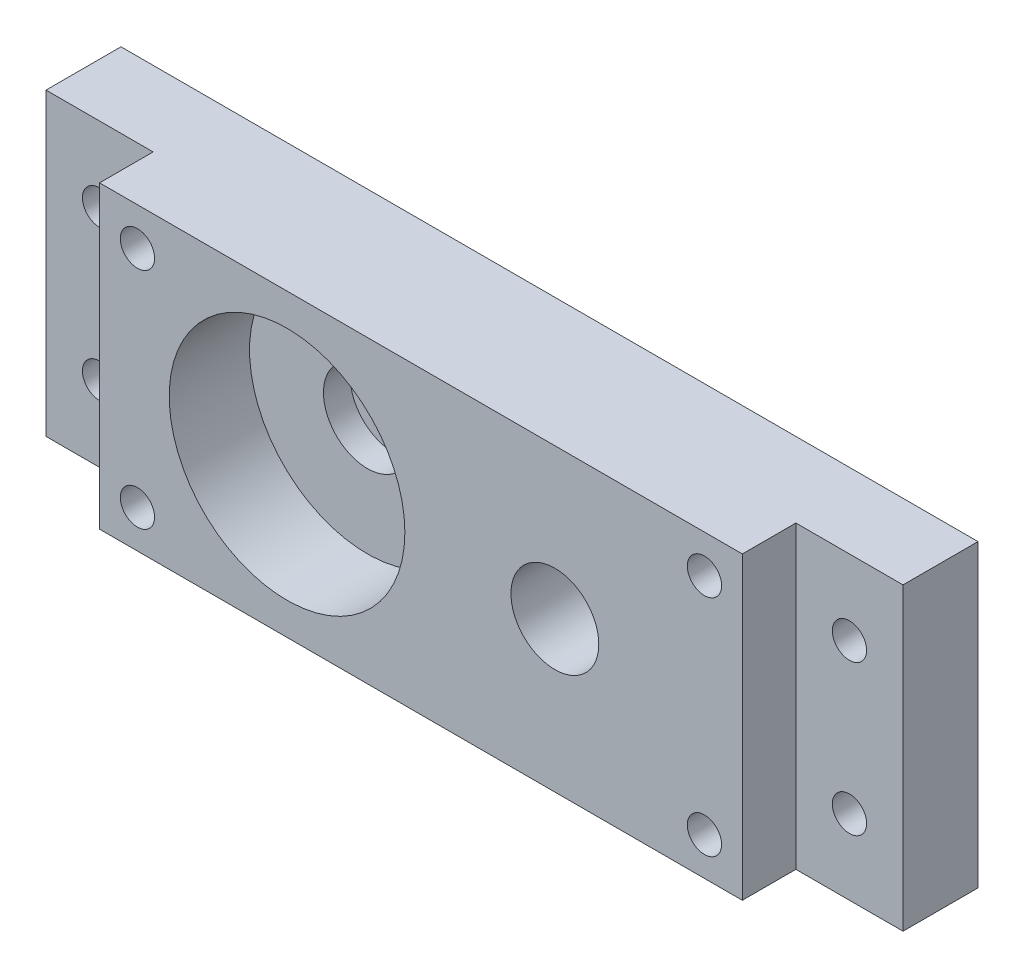
ISO-10303-21;
HEADER;
FILE_DESCRIPTION(('STEP AP214'),'2;1');
FILE_NAME('part.step','',(''),(''),'','','');
FILE_SCHEMA(('AUTOMOTIVE_DESIGN { 1 0 10303 214 1 1 1 1 }'));
ENDSEC;
DATA;
#1=APPLICATION_CONTEXT('core data for automotive mechanical design processes');
#2=APPLICATION_PROTOCOL_DEFINITION('international standard','automotive_design',2000,#1);
#3=PRODUCT_CONTEXT('',#1,'mechanical');
#4=PRODUCT('Part','Part','',(#3));
#5=PRODUCT_RELATED_PRODUCT_CATEGORY('part','',(#4));
#6=PRODUCT_DEFINITION_FORMATION('','',#4);
#7=PRODUCT_DEFINITION_CONTEXT('part definition',#1,'design');
#8=PRODUCT_DEFINITION('design','',#6,#7);
#9=PRODUCT_DEFINITION_SHAPE('','',#8);
#10=(LENGTH_UNIT() NAMED_UNIT(*) SI_UNIT(.MILLI.,.METRE.));
#11=(NAMED_UNIT(*) PLANE_ANGLE_UNIT() SI_UNIT($,.RADIAN.));
#12=(NAMED_UNIT(*) SI_UNIT($,.STERADIAN.) SOLID_ANGLE_UNIT());
#13=UNCERTAINTY_MEASURE_WITH_UNIT(LENGTH_MEASURE(1.E-05),#10,'distance_accuracy_value','');
#14=(GEOMETRIC_REPRESENTATION_CONTEXT(3) GLOBAL_UNCERTAINTY_ASSIGNED_CONTEXT((#13)) GLOBAL_UNIT_ASSIGNED_CONTEXT((#10,
#11,#12)) REPRESENTATION_CONTEXT('',''));
#15=CARTESIAN_POINT('',(0.,0.,0.));
#16=DIRECTION('',(0.,0.,1.));
#17=DIRECTION('',(1.,0.,0.));
#18=AXIS2_PLACEMENT_3D('',#15,#16,#17);
#19=CARTESIAN_POINT('',(-12.5,0.,10.));
#20=DIRECTION('',(0.,0.,-1.));
#21=DIRECTION('',(-1.,0.,0.));
#22=AXIS2_PLACEMENT_3D('',#19,#20,#21);
#23=CYLINDRICAL_SURFACE('',#22,4.1);
#24=CARTESIAN_POINT('',(-12.5,0.,0.));
#25=DIRECTION('',(0.,0.,1.));
#26=DIRECTION('',(1.,0.,0.));
#27=AXIS2_PLACEMENT_3D('',#24,#25,#26);
#28=CIRCLE('',#27,4.1);
#29=CARTESIAN_POINT('',(-8.4,0.,0.));
#30=VERTEX_POINT('',#29);
#31=EDGE_CURVE('E209',#30,#30,#28,.T.);
#32=ORIENTED_EDGE('',*,*,#31,.F.);
#33=EDGE_LOOP('',(#32));
#34=FACE_BOUND('',#33,.T.);
#35=CARTESIAN_POINT('',(-12.5,0.,2.5));
#36=DIRECTION('',(0.,0.,1.));
#37=DIRECTION('',(1.,0.,0.));
#38=AXIS2_PLACEMENT_3D('',#35,#36,#37);
#39=CIRCLE('',#38,4.1);
#40=CARTESIAN_POINT('',(-8.4,0.,2.5));
#41=VERTEX_POINT('',#40);
#42=EDGE_CURVE('E45',#41,#41,#39,.T.);
#43=ORIENTED_EDGE('',*,*,#42,.T.);
#44=EDGE_LOOP('',(#43));
#45=FACE_BOUND('',#44,.T.);
#46=ADVANCED_FACE('F41',(#34,#45),#23,.F.);
#47=CARTESIAN_POINT('',(0.,0.,10.));
#48=DIRECTION('',(0.,0.,1.));
#49=DIRECTION('',(1.,0.,0.));
#50=AXIS2_PLACEMENT_3D('',#47,#48,#49);
#51=PLANE('',#50);
#52=CARTESIAN_POINT('',(-12.5,0.,10.));
#53=DIRECTION('',(0.,0.,1.));
#54=DIRECTION('',(1.,0.,0.));
#55=AXIS2_PLACEMENT_3D('',#52,#53,#54);
#56=CIRCLE('',#55,11.);
#57=CARTESIAN_POINT('',(-1.5,0.,10.));
#58=VERTEX_POINT('',#57);
#59=EDGE_CURVE('E117',#58,#58,#56,.T.);
#60=ORIENTED_EDGE('',*,*,#59,.F.);
#61=EDGE_LOOP('',(#60));
#62=FACE_BOUND('',#61,.T.);
#63=CARTESIAN_POINT('',(26.4644660940674,-10.4644660940672,10.));
#64=DIRECTION('',(0.,0.,1.));
#65=DIRECTION('',(-1.,0.,0.));
#66=AXIS2_PLACEMENT_3D('',#63,#64,#65);
#67=CIRCLE('',#66,1.6);
#68=CARTESIAN_POINT('',(24.8644660940673,-10.4644660940672,10.));
#69=VERTEX_POINT('',#68);
#70=EDGE_CURVE('E194',#69,#69,#67,.T.);
#71=ORIENTED_EDGE('',*,*,#70,.F.);
#72=EDGE_LOOP('',(#71));
#73=FACE_BOUND('',#72,.T.);
#74=CARTESIAN_POINT('',(-26.4644660940673,10.4644660940673,10.));
#75=DIRECTION('',(0.,0.,1.));
#76=DIRECTION('',(1.,0.,0.));
#77=AXIS2_PLACEMENT_3D('',#74,#75,#76);
#78=CIRCLE('',#77,1.6);
#79=CARTESIAN_POINT('',(-24.8644660940673,10.4644660940673,10.));
#80=VERTEX_POINT('',#79);
#81=EDGE_CURVE('E206',#80,#80,#78,.T.);
#82=ORIENTED_EDGE('',*,*,#81,.F.);
#83=EDGE_LOOP('',(#82));
#84=FACE_BOUND('',#83,.T.);
#85=CARTESIAN_POINT('',(12.5,0.,10.));
#86=DIRECTION('',(0.,0.,1.));
#87=DIRECTION('',(1.,0.,0.));
#88=AXIS2_PLACEMENT_3D('',#85,#86,#87);
#89=CIRCLE('',#88,4.1);
#90=CARTESIAN_POINT('',(16.6,0.,10.));
#91=VERTEX_POINT('',#90);
#92=EDGE_CURVE('E215',#91,#91,#89,.T.);
#93=ORIENTED_EDGE('',*,*,#92,.F.);
#94=EDGE_LOOP('',(#93));
#95=FACE_BOUND('',#94,.T.);
#96=DIRECTION('',(0.,-1.,0.));
#97=VECTOR('',#96,1.);
#98=CARTESIAN_POINT('',(-30.,-14.,10.));
#99=LINE('',#98,#97);
#100=CARTESIAN_POINT('',(-30.,14.,10.));
#101=VERTEX_POINT('',#100);
#102=CARTESIAN_POINT('',(-30.,-14.,10.));
#103=VERTEX_POINT('',#102);
#104=EDGE_CURVE('E218',#101,#103,#99,.T.);
#105=ORIENTED_EDGE('',*,*,#104,.T.);
#106=DIRECTION('',(1.,0.,0.));
#107=VECTOR('',#106,1.);
#108=CARTESIAN_POINT('',(30.,-14.,10.));
#109=LINE('',#108,#107);
#110=CARTESIAN_POINT('',(30.,-14.,10.));
#111=VERTEX_POINT('',#110);
#112=EDGE_CURVE('E222',#103,#111,#109,.T.);
#113=ORIENTED_EDGE('',*,*,#112,.T.);
#114=DIRECTION('',(0.,1.,0.));
#115=VECTOR('',#114,1.);
#116=CARTESIAN_POINT('',(30.,-14.,10.));
#117=LINE('',#116,#115);
#118=CARTESIAN_POINT('',(30.,14.,10.));
#119=VERTEX_POINT('',#118);
#120=EDGE_CURVE('E62',#111,#119,#117,.T.);
#121=ORIENTED_EDGE('',*,*,#120,.T.);
#122=DIRECTION('',(-1.,0.,0.));
#123=VECTOR('',#122,1.);
#124=CARTESIAN_POINT('',(30.,14.,10.));
#125=LINE('',#124,#123);
#126=EDGE_CURVE('E57',#119,#101,#125,.T.);
#127=ORIENTED_EDGE('',*,*,#126,.T.);
#128=EDGE_LOOP('',(#105,#113,#121,#127));
#129=FACE_BOUND('',#128,.T.);
#130=CARTESIAN_POINT('',(-26.4644660940673,-10.4644660940673,10.));
#131=DIRECTION('',(0.,0.,1.));
#132=DIRECTION('',(1.,0.,0.));
#133=AXIS2_PLACEMENT_3D('',#130,#131,#132);
#134=CIRCLE('',#133,1.6);
#135=CARTESIAN_POINT('',(-24.8644660940673,-10.4644660940673,10.));
#136=VERTEX_POINT('',#135);
#137=EDGE_CURVE('E200',#136,#136,#134,.T.);
#138=ORIENTED_EDGE('',*,*,#137,.F.);
#139=EDGE_LOOP('',(#138));
#140=FACE_BOUND('',#139,.T.);
#141=CARTESIAN_POINT('',(26.4644660940673,10.4644660940674,10.));
#142=DIRECTION('',(0.,0.,1.));
#143=DIRECTION('',(-1.,0.,0.));
#144=AXIS2_PLACEMENT_3D('',#141,#142,#143);
#145=CIRCLE('',#144,1.6);
#146=CARTESIAN_POINT('',(24.8644660940673,10.4644660940674,10.));
#147=VERTEX_POINT('',#146);
#148=EDGE_CURVE('E187',#147,#147,#145,.T.);
#149=ORIENTED_EDGE('',*,*,#148,.F.);
#150=EDGE_LOOP('',(#149));
#151=FACE_BOUND('',#150,.T.);
#152=ADVANCED_FACE('F249',(#62,#73,#84,#95,#129,#140,#151),#51,.T.);
#153=CARTESIAN_POINT('',(-30.,-14.,10.));
#154=DIRECTION('',(1.,0.,0.));
#155=DIRECTION('',(0.,0.,-1.));
#156=AXIS2_PLACEMENT_3D('',#153,#154,#155);
#157=PLANE('',#156);
#158=DIRECTION('',(0.,0.,-1.));
#159=VECTOR('',#158,1.);
#160=CARTESIAN_POINT('',(-30.,14.,10.));
#161=LINE('',#160,#159);
#162=CARTESIAN_POINT('',(-30.,14.,5.));
#163=VERTEX_POINT('',#162);
#164=EDGE_CURVE('E226',#101,#163,#161,.T.);
#165=ORIENTED_EDGE('',*,*,#164,.T.);
#166=DIRECTION('',(0.,1.,0.));
#167=VECTOR('',#166,1.);
#168=CARTESIAN_POINT('',(-30.,-14.,5.));
#169=LINE('',#168,#167);
#170=CARTESIAN_POINT('',(-30.,-14.,5.));
#171=VERTEX_POINT('',#170);
#172=EDGE_CURVE('E127',#171,#163,#169,.T.);
#173=ORIENTED_EDGE('',*,*,#172,.F.);
#174=DIRECTION('',(0.,0.,-1.));
#175=VECTOR('',#174,1.);
#176=CARTESIAN_POINT('',(-30.,-14.,10.));
#177=LINE('',#176,#175);
#178=EDGE_CURVE('E12',#103,#171,#177,.T.);
#179=ORIENTED_EDGE('',*,*,#178,.F.);
#180=ORIENTED_EDGE('',*,*,#104,.F.);
#181=EDGE_LOOP('',(#165,#173,#179,#180));
#182=FACE_BOUND('',#181,.T.);
#183=ADVANCED_FACE('F43',(#182),#157,.F.);
#184=CARTESIAN_POINT('',(30.,-14.,10.));
#185=DIRECTION('',(0.,1.,0.));
#186=DIRECTION('',(-1.,0.,0.));
#187=AXIS2_PLACEMENT_3D('',#184,#185,#186);
#188=PLANE('',#187);
#189=ORIENTED_EDGE('',*,*,#178,.T.);
#190=DIRECTION('',(1.,0.,0.));
#191=VECTOR('',#190,1.);
#192=CARTESIAN_POINT('',(-40.,-14.,5.));
#193=LINE('',#192,#191);
#194=CARTESIAN_POINT('',(-40.,-14.,5.));
#195=VERTEX_POINT('',#194);
#196=EDGE_CURVE('E120',#195,#171,#193,.T.);
#197=ORIENTED_EDGE('',*,*,#196,.F.);
#198=DIRECTION('',(0.,0.,1.));
#199=VECTOR('',#198,1.);
#200=CARTESIAN_POINT('',(-40.,-14.,-2.));
#201=LINE('',#200,#199);
#202=CARTESIAN_POINT('',(-40.,-14.,-2.));
#203=VERTEX_POINT('',#202);
#204=EDGE_CURVE('E107',#203,#195,#201,.T.);
#205=ORIENTED_EDGE('',*,*,#204,.F.);
#206=DIRECTION('',(-1.,0.,0.));
#207=VECTOR('',#206,1.);
#208=CARTESIAN_POINT('',(-30.,-14.,-2.));
#209=LINE('',#208,#207);
#210=CARTESIAN_POINT('',(40.,-14.,-2.));
#211=VERTEX_POINT('',#210);
#212=EDGE_CURVE('E169',#211,#203,#209,.T.);
#213=ORIENTED_EDGE('',*,*,#212,.F.);
#214=DIRECTION('',(0.,0.,1.));
#215=VECTOR('',#214,1.);
#216=CARTESIAN_POINT('',(40.,-14.,-2.));
#217=LINE('',#216,#215);
#218=CARTESIAN_POINT('',(40.,-14.,5.));
#219=VERTEX_POINT('',#218);
#220=EDGE_CURVE('E177',#211,#219,#217,.T.);
#221=ORIENTED_EDGE('',*,*,#220,.T.);
#222=DIRECTION('',(1.,0.,0.));
#223=VECTOR('',#222,1.);
#224=CARTESIAN_POINT('',(30.,-14.,5.));
#225=LINE('',#224,#223);
#226=CARTESIAN_POINT('',(30.,-14.,5.));
#227=VERTEX_POINT('',#226);
#228=EDGE_CURVE('E147',#227,#219,#225,.T.);
#229=ORIENTED_EDGE('',*,*,#228,.F.);
#230=DIRECTION('',(0.,0.,-1.));
#231=VECTOR('',#230,1.);
#232=CARTESIAN_POINT('',(30.,-14.,10.));
#233=LINE('',#232,#231);
#234=EDGE_CURVE('E50',#111,#227,#233,.T.);
#235=ORIENTED_EDGE('',*,*,#234,.F.);
#236=ORIENTED_EDGE('',*,*,#112,.F.);
#237=EDGE_LOOP('',(#189,#197,#205,#213,#221,#229,#235,#236));
#238=FACE_BOUND('',#237,.T.);
#239=ADVANCED_FACE('F121',(#238),#188,.F.);
#240=CARTESIAN_POINT('',(30.,-14.,10.));
#241=DIRECTION('',(-1.,0.,0.));
#242=DIRECTION('',(0.,0.,1.));
#243=AXIS2_PLACEMENT_3D('',#240,#241,#242);
#244=PLANE('',#243);
#245=ORIENTED_EDGE('',*,*,#234,.T.);
#246=DIRECTION('',(0.,-1.,0.));
#247=VECTOR('',#246,1.);
#248=CARTESIAN_POINT('',(30.,14.,5.));
#249=LINE('',#248,#247);
#250=CARTESIAN_POINT('',(30.,14.,5.));
#251=VERTEX_POINT('',#250);
#252=EDGE_CURVE('E150',#251,#227,#249,.T.);
#253=ORIENTED_EDGE('',*,*,#252,.F.);
#254=DIRECTION('',(0.,0.,-1.));
#255=VECTOR('',#254,1.);
#256=CARTESIAN_POINT('',(30.,14.,10.));
#257=LINE('',#256,#255);
#258=EDGE_CURVE('E229',#119,#251,#257,.T.);
#259=ORIENTED_EDGE('',*,*,#258,.F.);
#260=ORIENTED_EDGE('',*,*,#120,.F.);
#261=EDGE_LOOP('',(#245,#253,#259,#260));
#262=FACE_BOUND('',#261,.T.);
#263=ADVANCED_FACE('F236',(#262),#244,.F.);
#264=CARTESIAN_POINT('',(30.,14.,10.));
#265=DIRECTION('',(0.,-1.,0.));
#266=DIRECTION('',(1.,0.,0.));
#267=AXIS2_PLACEMENT_3D('',#264,#265,#266);
#268=PLANE('',#267);
#269=ORIENTED_EDGE('',*,*,#258,.T.);
#270=DIRECTION('',(-1.,0.,0.));
#271=VECTOR('',#270,1.);
#272=CARTESIAN_POINT('',(40.,14.,5.));
#273=LINE('',#272,#271);
#274=CARTESIAN_POINT('',(40.,14.,5.));
#275=VERTEX_POINT('',#274);
#276=EDGE_CURVE('E153',#275,#251,#273,.T.);
#277=ORIENTED_EDGE('',*,*,#276,.F.);
#278=DIRECTION('',(0.,0.,1.));
#279=VECTOR('',#278,1.);
#280=CARTESIAN_POINT('',(40.,14.,-2.));
#281=LINE('',#280,#279);
#282=CARTESIAN_POINT('',(40.,14.,-2.));
#283=VERTEX_POINT('',#282);
#284=EDGE_CURVE('E179',#283,#275,#281,.T.);
#285=ORIENTED_EDGE('',*,*,#284,.F.);
#286=DIRECTION('',(1.,0.,0.));
#287=VECTOR('',#286,1.);
#288=CARTESIAN_POINT('',(-30.,14.,-2.));
#289=LINE('',#288,#287);
#290=CARTESIAN_POINT('',(-40.,14.,-2.));
#291=VERTEX_POINT('',#290);
#292=EDGE_CURVE('E172',#291,#283,#289,.T.);
#293=ORIENTED_EDGE('',*,*,#292,.F.);
#294=DIRECTION('',(0.,0.,1.));
#295=VECTOR('',#294,1.);
#296=CARTESIAN_POINT('',(-40.,14.,-2.));
#297=LINE('',#296,#295);
#298=CARTESIAN_POINT('',(-40.,14.,5.));
#299=VERTEX_POINT('',#298);
#300=EDGE_CURVE('E118',#291,#299,#297,.T.);
#301=ORIENTED_EDGE('',*,*,#300,.T.);
#302=DIRECTION('',(-1.,0.,0.));
#303=VECTOR('',#302,1.);
#304=CARTESIAN_POINT('',(-30.,14.,5.));
#305=LINE('',#304,#303);
#306=EDGE_CURVE('E130',#163,#299,#305,.T.);
#307=ORIENTED_EDGE('',*,*,#306,.F.);
#308=ORIENTED_EDGE('',*,*,#164,.F.);
#309=ORIENTED_EDGE('',*,*,#126,.F.);
#310=EDGE_LOOP('',(#269,#277,#285,#293,#301,#307,#308,#309));
#311=FACE_BOUND('',#310,.T.);
#312=ADVANCED_FACE('F244',(#311),#268,.F.);
#313=CARTESIAN_POINT('',(12.5,0.,10.));
#314=DIRECTION('',(0.,0.,-1.));
#315=DIRECTION('',(-1.,0.,0.));
#316=AXIS2_PLACEMENT_3D('',#313,#314,#315);
#317=CYLINDRICAL_SURFACE('',#316,4.1);
#318=ORIENTED_EDGE('',*,*,#92,.T.);
#319=EDGE_LOOP('',(#318));
#320=FACE_BOUND('',#319,.T.);
#321=CARTESIAN_POINT('',(12.5,0.,0.));
#322=DIRECTION('',(0.,0.,1.));
#323=DIRECTION('',(1.,0.,0.));
#324=AXIS2_PLACEMENT_3D('',#321,#322,#323);
#325=CIRCLE('',#324,4.1);
#326=CARTESIAN_POINT('',(16.6,0.,0.));
#327=VERTEX_POINT('',#326);
#328=EDGE_CURVE('E214',#327,#327,#325,.T.);
#329=ORIENTED_EDGE('',*,*,#328,.F.);
#330=EDGE_LOOP('',(#329));
#331=FACE_BOUND('',#330,.T.);
#332=ADVANCED_FACE('F298',(#320,#331),#317,.F.);
#333=CARTESIAN_POINT('',(-26.4644660940673,10.4644660940673,10.));
#334=DIRECTION('',(0.,0.,-1.));
#335=DIRECTION('',(-1.,0.,0.));
#336=AXIS2_PLACEMENT_3D('',#333,#334,#335);
#337=CYLINDRICAL_SURFACE('',#336,1.6);
#338=ORIENTED_EDGE('',*,*,#81,.T.);
#339=EDGE_LOOP('',(#338));
#340=FACE_BOUND('',#339,.T.);
#341=CARTESIAN_POINT('',(-26.4644660940673,10.4644660940673,0.));
#342=DIRECTION('',(0.,0.,1.));
#343=DIRECTION('',(1.,0.,0.));
#344=AXIS2_PLACEMENT_3D('',#341,#342,#343);
#345=CIRCLE('',#344,1.6);
#346=CARTESIAN_POINT('',(-24.8644660940673,10.4644660940673,0.));
#347=VERTEX_POINT('',#346);
#348=EDGE_CURVE('E203',#347,#347,#345,.T.);
#349=ORIENTED_EDGE('',*,*,#348,.F.);
#350=EDGE_LOOP('',(#349));
#351=FACE_BOUND('',#350,.T.);
#352=ADVANCED_FACE('F296',(#340,#351),#337,.F.);
#353=CARTESIAN_POINT('',(-26.4644660940673,-10.4644660940673,10.));
#354=DIRECTION('',(0.,0.,-1.));
#355=DIRECTION('',(-1.,0.,0.));
#356=AXIS2_PLACEMENT_3D('',#353,#354,#355);
#357=CYLINDRICAL_SURFACE('',#356,1.6);
#358=ORIENTED_EDGE('',*,*,#137,.T.);
#359=EDGE_LOOP('',(#358));
#360=FACE_BOUND('',#359,.T.);
#361=CARTESIAN_POINT('',(-26.4644660940673,-10.4644660940673,0.));
#362=DIRECTION('',(0.,0.,1.));
#363=DIRECTION('',(1.,0.,0.));
#364=AXIS2_PLACEMENT_3D('',#361,#362,#363);
#365=CIRCLE('',#364,1.6);
#366=CARTESIAN_POINT('',(-24.8644660940673,-10.4644660940673,0.));
#367=VERTEX_POINT('',#366);
#368=EDGE_CURVE('E197',#367,#367,#365,.T.);
#369=ORIENTED_EDGE('',*,*,#368,.F.);
#370=EDGE_LOOP('',(#369));
#371=FACE_BOUND('',#370,.T.);
#372=ADVANCED_FACE('F504',(#360,#371),#357,.F.);
#373=CARTESIAN_POINT('',(26.4644660940674,-10.4644660940672,10.));
#374=DIRECTION('',(0.,0.,-1.));
#375=DIRECTION('',(-1.,0.,0.));
#376=AXIS2_PLACEMENT_3D('',#373,#374,#375);
#377=CYLINDRICAL_SURFACE('',#376,1.6);
#378=ORIENTED_EDGE('',*,*,#70,.T.);
#379=EDGE_LOOP('',(#378));
#380=FACE_BOUND('',#379,.T.);
#381=CARTESIAN_POINT('',(26.4644660940674,-10.4644660940672,0.));
#382=DIRECTION('',(0.,0.,1.));
#383=DIRECTION('',(-1.,0.,0.));
#384=AXIS2_PLACEMENT_3D('',#381,#382,#383);
#385=CIRCLE('',#384,1.6);
#386=CARTESIAN_POINT('',(24.8644660940673,-10.4644660940672,0.));
#387=VERTEX_POINT('',#386);
#388=EDGE_CURVE('E190',#387,#387,#385,.T.);
#389=ORIENTED_EDGE('',*,*,#388,.F.);
#390=EDGE_LOOP('',(#389));
#391=FACE_BOUND('',#390,.T.);
#392=ADVANCED_FACE('F262',(#380,#391),#377,.F.);
#393=CARTESIAN_POINT('',(26.4644660940673,10.4644660940674,10.));
#394=DIRECTION('',(0.,0.,-1.));
#395=DIRECTION('',(-1.,0.,0.));
#396=AXIS2_PLACEMENT_3D('',#393,#394,#395);
#397=CYLINDRICAL_SURFACE('',#396,1.6);
#398=ORIENTED_EDGE('',*,*,#148,.T.);
#399=EDGE_LOOP('',(#398));
#400=FACE_BOUND('',#399,.T.);
#401=CARTESIAN_POINT('',(26.4644660940673,10.4644660940674,0.));
#402=DIRECTION('',(0.,0.,1.));
#403=DIRECTION('',(-1.,0.,0.));
#404=AXIS2_PLACEMENT_3D('',#401,#402,#403);
#405=CIRCLE('',#404,1.6);
#406=CARTESIAN_POINT('',(24.8644660940673,10.4644660940674,0.));
#407=VERTEX_POINT('',#406);
#408=EDGE_CURVE('E191',#407,#407,#405,.T.);
#409=ORIENTED_EDGE('',*,*,#408,.F.);
#410=EDGE_LOOP('',(#409));
#411=FACE_BOUND('',#410,.T.);
#412=ADVANCED_FACE('F258',(#400,#411),#397,.F.);
#413=CARTESIAN_POINT('',(-12.5,0.,2.5));
#414=DIRECTION('',(0.,0.,1.));
#415=DIRECTION('',(1.,0.,0.));
#416=AXIS2_PLACEMENT_3D('',#413,#414,#415);
#417=CYLINDRICAL_SURFACE('',#416,11.);
#418=CARTESIAN_POINT('',(-12.5,0.,2.5));
#419=DIRECTION('',(0.,0.,1.));
#420=DIRECTION('',(1.,0.,0.));
#421=AXIS2_PLACEMENT_3D('',#418,#419,#420);
#422=CIRCLE('',#421,11.);
#423=CARTESIAN_POINT('',(-1.5,0.,2.5));
#424=VERTEX_POINT('',#423);
#425=EDGE_CURVE('E182',#424,#424,#422,.T.);
#426=ORIENTED_EDGE('',*,*,#425,.F.);
#427=EDGE_LOOP('',(#426));
#428=FACE_BOUND('',#427,.T.);
#429=ORIENTED_EDGE('',*,*,#59,.T.);
#430=EDGE_LOOP('',(#429));
#431=FACE_BOUND('',#430,.T.);
#432=ADVANCED_FACE('F261',(#428,#431),#417,.F.);
#433=CARTESIAN_POINT('',(-12.5,0.,2.5));
#434=DIRECTION('',(0.,0.,1.));
#435=DIRECTION('',(1.,0.,0.));
#436=AXIS2_PLACEMENT_3D('',#433,#434,#435);
#437=PLANE('',#436);
#438=ORIENTED_EDGE('',*,*,#42,.F.);
#439=EDGE_LOOP('',(#438));
#440=FACE_BOUND('',#439,.T.);
#441=ORIENTED_EDGE('',*,*,#425,.T.);
#442=EDGE_LOOP('',(#441));
#443=FACE_BOUND('',#442,.T.);
#444=ADVANCED_FACE('F269',(#440,#443),#437,.T.);
#445=CARTESIAN_POINT('',(0.,0.,0.));
#446=DIRECTION('',(0.,0.,1.));
#447=DIRECTION('',(1.,0.,0.));
#448=AXIS2_PLACEMENT_3D('',#445,#446,#447);
#449=PLANE('',#448);
#450=ORIENTED_EDGE('',*,*,#408,.T.);
#451=EDGE_LOOP('',(#450));
#452=FACE_BOUND('',#451,.T.);
#453=ADVANCED_FACE('F266',(#452),#449,.T.);
#454=ORIENTED_EDGE('',*,*,#388,.T.);
#455=EDGE_LOOP('',(#454));
#456=FACE_BOUND('',#455,.T.);
#457=ADVANCED_FACE('F268',(#456),#449,.T.);
#458=ORIENTED_EDGE('',*,*,#368,.T.);
#459=EDGE_LOOP('',(#458));
#460=FACE_BOUND('',#459,.T.);
#461=ADVANCED_FACE('F276',(#460),#449,.T.);
#462=ORIENTED_EDGE('',*,*,#348,.T.);
#463=EDGE_LOOP('',(#462));
#464=FACE_BOUND('',#463,.T.);
#465=ADVANCED_FACE('F441',(#464),#449,.T.);
#466=ORIENTED_EDGE('',*,*,#31,.T.);
#467=EDGE_LOOP('',(#466));
#468=FACE_BOUND('',#467,.T.);
#469=ADVANCED_FACE('F285',(#468),#449,.T.);
#470=ORIENTED_EDGE('',*,*,#328,.T.);
#471=EDGE_LOOP('',(#470));
#472=FACE_BOUND('',#471,.T.);
#473=ADVANCED_FACE('F271',(#472),#449,.T.);
#474=CARTESIAN_POINT('',(0.,0.,-2.));
#475=DIRECTION('',(0.,0.,1.));
#476=DIRECTION('',(1.,0.,0.));
#477=AXIS2_PLACEMENT_3D('',#474,#475,#476);
#478=PLANE('',#477);
#479=ORIENTED_EDGE('',*,*,#212,.T.);
#480=DIRECTION('',(0.,1.,0.));
#481=VECTOR('',#480,1.);
#482=CARTESIAN_POINT('',(-40.,14.,-2.));
#483=LINE('',#482,#481);
#484=EDGE_CURVE('E114',#203,#291,#483,.T.);
#485=ORIENTED_EDGE('',*,*,#484,.T.);
#486=ORIENTED_EDGE('',*,*,#292,.T.);
#487=DIRECTION('',(0.,-1.,0.));
#488=VECTOR('',#487,1.);
#489=CARTESIAN_POINT('',(40.,14.,-2.));
#490=LINE('',#489,#488);
#491=EDGE_CURVE('E174',#283,#211,#490,.T.);
#492=ORIENTED_EDGE('',*,*,#491,.T.);
#493=EDGE_LOOP('',(#479,#485,#486,#492));
#494=FACE_BOUND('',#493,.T.);
#495=CARTESIAN_POINT('',(35.,7.00000000000001,-2.));
#496=DIRECTION('',(0.,0.,-1.));
#497=DIRECTION('',(-1.,0.,0.));
#498=AXIS2_PLACEMENT_3D('',#495,#496,#497);
#499=CIRCLE('',#498,1.6);
#500=CARTESIAN_POINT('',(33.4,7.00000000000001,-2.));
#501=VERTEX_POINT('',#500);
#502=EDGE_CURVE('E166',#501,#501,#499,.T.);
#503=ORIENTED_EDGE('',*,*,#502,.F.);
#504=EDGE_LOOP('',(#503));
#505=FACE_BOUND('',#504,.T.);
#506=CARTESIAN_POINT('',(35.,-6.99999999999999,-2.));
#507=DIRECTION('',(0.,0.,-1.));
#508=DIRECTION('',(-1.,0.,0.));
#509=AXIS2_PLACEMENT_3D('',#506,#507,#508);
#510=CIRCLE('',#509,1.6);
#511=CARTESIAN_POINT('',(33.4,-6.99999999999999,-2.));
#512=VERTEX_POINT('',#511);
#513=EDGE_CURVE('E163',#512,#512,#510,.T.);
#514=ORIENTED_EDGE('',*,*,#513,.F.);
#515=EDGE_LOOP('',(#514));
#516=FACE_BOUND('',#515,.T.);
#517=CARTESIAN_POINT('',(-35.,-7.00000000000008,-2.));
#518=DIRECTION('',(0.,0.,-1.));
#519=DIRECTION('',(1.,0.,0.));
#520=AXIS2_PLACEMENT_3D('',#517,#518,#519);
#521=CIRCLE('',#520,1.6);
#522=CARTESIAN_POINT('',(-33.3999999999999,-7.00000000000008,-2.));
#523=VERTEX_POINT('',#522);
#524=EDGE_CURVE('E160',#523,#523,#521,.T.);
#525=ORIENTED_EDGE('',*,*,#524,.F.);
#526=EDGE_LOOP('',(#525));
#527=FACE_BOUND('',#526,.T.);
#528=CARTESIAN_POINT('',(-35.,6.99999999999992,-2.));
#529=DIRECTION('',(0.,0.,-1.));
#530=DIRECTION('',(1.,0.,0.));
#531=AXIS2_PLACEMENT_3D('',#528,#529,#530);
#532=CIRCLE('',#531,1.6);
#533=CARTESIAN_POINT('',(-33.4,6.99999999999992,-2.));
#534=VERTEX_POINT('',#533);
#535=EDGE_CURVE('E155',#534,#534,#532,.T.);
#536=ORIENTED_EDGE('',*,*,#535,.F.);
#537=EDGE_LOOP('',(#536));
#538=FACE_BOUND('',#537,.T.);
#539=ADVANCED_FACE('F284',(#494,#505,#516,#527,#538),#478,.F.);
#540=CARTESIAN_POINT('',(-40.,14.,-2.));
#541=DIRECTION('',(1.,0.,0.));
#542=DIRECTION('',(0.,0.,-1.));
#543=AXIS2_PLACEMENT_3D('',#540,#541,#542);
#544=PLANE('',#543);
#545=ORIENTED_EDGE('',*,*,#204,.T.);
#546=DIRECTION('',(0.,-1.,0.));
#547=VECTOR('',#546,1.);
#548=CARTESIAN_POINT('',(-40.,14.,5.));
#549=LINE('',#548,#547);
#550=EDGE_CURVE('E112',#299,#195,#549,.T.);
#551=ORIENTED_EDGE('',*,*,#550,.F.);
#552=ORIENTED_EDGE('',*,*,#300,.F.);
#553=ORIENTED_EDGE('',*,*,#484,.F.);
#554=EDGE_LOOP('',(#545,#551,#552,#553));
#555=FACE_BOUND('',#554,.T.);
#556=ADVANCED_FACE('F109',(#555),#544,.F.);
#557=CARTESIAN_POINT('',(40.,14.,-2.));
#558=DIRECTION('',(-1.,0.,0.));
#559=DIRECTION('',(0.,0.,1.));
#560=AXIS2_PLACEMENT_3D('',#557,#558,#559);
#561=PLANE('',#560);
#562=ORIENTED_EDGE('',*,*,#284,.T.);
#563=DIRECTION('',(0.,1.,0.));
#564=VECTOR('',#563,1.);
#565=CARTESIAN_POINT('',(40.,-14.,5.));
#566=LINE('',#565,#564);
#567=EDGE_CURVE('E144',#219,#275,#566,.T.);
#568=ORIENTED_EDGE('',*,*,#567,.F.);
#569=ORIENTED_EDGE('',*,*,#220,.F.);
#570=ORIENTED_EDGE('',*,*,#491,.F.);
#571=EDGE_LOOP('',(#562,#568,#569,#570));
#572=FACE_BOUND('',#571,.T.);
#573=ADVANCED_FACE('F338',(#572),#561,.F.);
#574=CARTESIAN_POINT('',(35.,7.00000000000001,-2.));
#575=DIRECTION('',(0.,0.,1.));
#576=DIRECTION('',(1.,0.,0.));
#577=AXIS2_PLACEMENT_3D('',#574,#575,#576);
#578=CYLINDRICAL_SURFACE('',#577,1.6);
#579=ORIENTED_EDGE('',*,*,#502,.T.);
#580=EDGE_LOOP('',(#579));
#581=FACE_BOUND('',#580,.T.);
#582=CARTESIAN_POINT('',(35.,7.00000000000001,5.));
#583=DIRECTION('',(0.,0.,1.));
#584=DIRECTION('',(1.,0.,0.));
#585=AXIS2_PLACEMENT_3D('',#582,#583,#584);
#586=CIRCLE('',#585,1.6);
#587=CARTESIAN_POINT('',(36.6,7.00000000000001,5.));
#588=VERTEX_POINT('',#587);
#589=EDGE_CURVE('E126',#588,#588,#586,.T.);
#590=ORIENTED_EDGE('',*,*,#589,.T.);
#591=EDGE_LOOP('',(#590));
#592=FACE_BOUND('',#591,.T.);
#593=ADVANCED_FACE('F348',(#581,#592),#578,.F.);
#594=CARTESIAN_POINT('',(35.,-6.99999999999999,-2.));
#595=DIRECTION('',(0.,0.,1.));
#596=DIRECTION('',(1.,0.,0.));
#597=AXIS2_PLACEMENT_3D('',#594,#595,#596);
#598=CYLINDRICAL_SURFACE('',#597,1.6);
#599=ORIENTED_EDGE('',*,*,#513,.T.);
#600=EDGE_LOOP('',(#599));
#601=FACE_BOUND('',#600,.T.);
#602=CARTESIAN_POINT('',(35.,-6.99999999999999,5.));
#603=DIRECTION('',(0.,0.,1.));
#604=DIRECTION('',(1.,0.,0.));
#605=AXIS2_PLACEMENT_3D('',#602,#603,#604);
#606=CIRCLE('',#605,1.6);
#607=CARTESIAN_POINT('',(36.6,-6.99999999999999,5.));
#608=VERTEX_POINT('',#607);
#609=EDGE_CURVE('E141',#608,#608,#606,.T.);
#610=ORIENTED_EDGE('',*,*,#609,.T.);
#611=EDGE_LOOP('',(#610));
#612=FACE_BOUND('',#611,.T.);
#613=ADVANCED_FACE('F358',(#601,#612),#598,.F.);
#614=CARTESIAN_POINT('',(-35.,-7.00000000000008,-2.));
#615=DIRECTION('',(0.,0.,1.));
#616=DIRECTION('',(1.,0.,0.));
#617=AXIS2_PLACEMENT_3D('',#614,#615,#616);
#618=CYLINDRICAL_SURFACE('',#617,1.6);
#619=ORIENTED_EDGE('',*,*,#524,.T.);
#620=EDGE_LOOP('',(#619));
#621=FACE_BOUND('',#620,.T.);
#622=CARTESIAN_POINT('',(-35.,-7.00000000000008,5.));
#623=DIRECTION('',(0.,0.,1.));
#624=DIRECTION('',(1.,0.,0.));
#625=AXIS2_PLACEMENT_3D('',#622,#623,#624);
#626=CIRCLE('',#625,1.6);
#627=CARTESIAN_POINT('',(-33.3999999999999,-7.00000000000008,5.));
#628=VERTEX_POINT('',#627);
#629=EDGE_CURVE('E131',#628,#628,#626,.T.);
#630=ORIENTED_EDGE('',*,*,#629,.T.);
#631=EDGE_LOOP('',(#630));
#632=FACE_BOUND('',#631,.T.);
#633=ADVANCED_FACE('F369',(#621,#632),#618,.F.);
#634=CARTESIAN_POINT('',(-35.,6.99999999999992,-2.));
#635=DIRECTION('',(0.,0.,1.));
#636=DIRECTION('',(1.,0.,0.));
#637=AXIS2_PLACEMENT_3D('',#634,#635,#636);
#638=CYLINDRICAL_SURFACE('',#637,1.6);
#639=ORIENTED_EDGE('',*,*,#535,.T.);
#640=EDGE_LOOP('',(#639));
#641=FACE_BOUND('',#640,.T.);
#642=CARTESIAN_POINT('',(-35.,6.99999999999992,5.));
#643=DIRECTION('',(0.,0.,1.));
#644=DIRECTION('',(1.,0.,0.));
#645=AXIS2_PLACEMENT_3D('',#642,#643,#644);
#646=CIRCLE('',#645,1.6);
#647=CARTESIAN_POINT('',(-33.4,6.99999999999992,5.));
#648=VERTEX_POINT('',#647);
#649=EDGE_CURVE('E135',#648,#648,#646,.T.);
#650=ORIENTED_EDGE('',*,*,#649,.T.);
#651=EDGE_LOOP('',(#650));
#652=FACE_BOUND('',#651,.T.);
#653=ADVANCED_FACE('F380',(#641,#652),#638,.F.);
#654=CARTESIAN_POINT('',(0.,0.,5.));
#655=DIRECTION('',(0.,0.,1.));
#656=DIRECTION('',(1.,0.,0.));
#657=AXIS2_PLACEMENT_3D('',#654,#655,#656);
#658=PLANE('',#657);
#659=ORIENTED_EDGE('',*,*,#589,.F.);
#660=EDGE_LOOP('',(#659));
#661=FACE_BOUND('',#660,.T.);
#662=ORIENTED_EDGE('',*,*,#609,.F.);
#663=EDGE_LOOP('',(#662));
#664=FACE_BOUND('',#663,.T.);
#665=ORIENTED_EDGE('',*,*,#567,.T.);
#666=ORIENTED_EDGE('',*,*,#276,.T.);
#667=ORIENTED_EDGE('',*,*,#252,.T.);
#668=ORIENTED_EDGE('',*,*,#228,.T.);
#669=EDGE_LOOP('',(#665,#666,#667,#668));
#670=FACE_BOUND('',#669,.T.);
#671=ADVANCED_FACE('F240',(#661,#664,#670),#658,.T.);
#672=CARTESIAN_POINT('',(0.,0.,5.));
#673=DIRECTION('',(0.,0.,1.));
#674=DIRECTION('',(1.,0.,0.));
#675=AXIS2_PLACEMENT_3D('',#672,#673,#674);
#676=PLANE('',#675);
#677=ORIENTED_EDGE('',*,*,#649,.F.);
#678=EDGE_LOOP('',(#677));
#679=FACE_BOUND('',#678,.T.);
#680=ORIENTED_EDGE('',*,*,#629,.F.);
#681=EDGE_LOOP('',(#680));
#682=FACE_BOUND('',#681,.T.);
#683=ORIENTED_EDGE('',*,*,#550,.T.);
#684=ORIENTED_EDGE('',*,*,#196,.T.);
#685=ORIENTED_EDGE('',*,*,#172,.T.);
#686=ORIENTED_EDGE('',*,*,#306,.T.);
#687=EDGE_LOOP('',(#683,#684,#685,#686));
#688=FACE_BOUND('',#687,.T.);
#689=ADVANCED_FACE('F129',(#679,#682,#688),#676,.T.);
#690=CLOSED_SHELL('',(#46,#152,#183,#239,#263,#312,#332,#352,#372,#392,#412,#432,#444,#453,#457,
#461,#465,#469,#473,#539,#556,#573,#593,#613,#633,#653,#671,#689));
#691=MANIFOLD_SOLID_BREP('B2',#690);
#692=ADVANCED_BREP_SHAPE_REPRESENTATION('',(#18,#691),#14);
#693=SHAPE_DEFINITION_REPRESENTATION(#9,#692);
ENDSEC;
END-ISO-10303-21;
